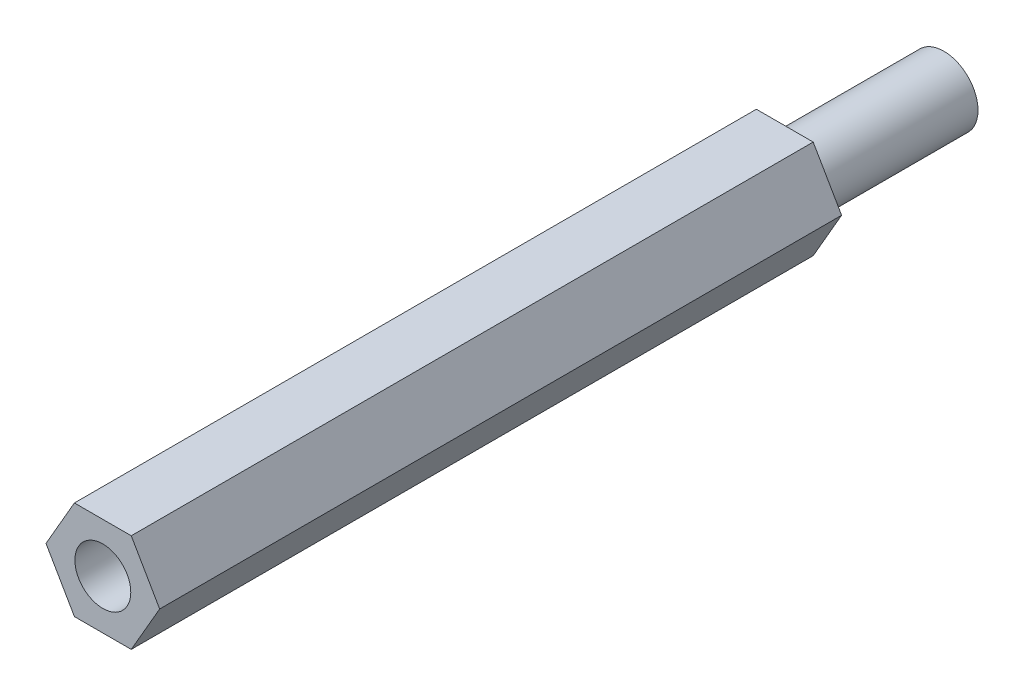
ISO-10303-21;
HEADER;
FILE_DESCRIPTION(('STEP AP214'),'2;1');
FILE_NAME('part.step','',(''),(''),'','','');
FILE_SCHEMA(('AUTOMOTIVE_DESIGN { 1 0 10303 214 1 1 1 1 }'));
ENDSEC;
DATA;
#1=APPLICATION_CONTEXT('core data for automotive mechanical design processes');
#2=APPLICATION_PROTOCOL_DEFINITION('international standard','automotive_design',2000,#1);
#3=PRODUCT_CONTEXT('',#1,'mechanical');
#4=PRODUCT('Part','Part','',(#3));
#5=PRODUCT_RELATED_PRODUCT_CATEGORY('part','',(#4));
#6=PRODUCT_DEFINITION_FORMATION('','',#4);
#7=PRODUCT_DEFINITION_CONTEXT('part definition',#1,'design');
#8=PRODUCT_DEFINITION('design','',#6,#7);
#9=PRODUCT_DEFINITION_SHAPE('','',#8);
#10=(LENGTH_UNIT() NAMED_UNIT(*) SI_UNIT(.MILLI.,.METRE.));
#11=(NAMED_UNIT(*) PLANE_ANGLE_UNIT() SI_UNIT($,.RADIAN.));
#12=(NAMED_UNIT(*) SI_UNIT($,.STERADIAN.) SOLID_ANGLE_UNIT());
#13=UNCERTAINTY_MEASURE_WITH_UNIT(LENGTH_MEASURE(1.E-05),#10,'distance_accuracy_value','');
#14=(GEOMETRIC_REPRESENTATION_CONTEXT(3) GLOBAL_UNCERTAINTY_ASSIGNED_CONTEXT((#13)) GLOBAL_UNIT_ASSIGNED_CONTEXT((#10,
#11,#12)) REPRESENTATION_CONTEXT('',''));
#15=CARTESIAN_POINT('',(0.,0.,0.));
#16=DIRECTION('',(0.,0.,1.));
#17=DIRECTION('',(1.,0.,0.));
#18=AXIS2_PLACEMENT_3D('',#15,#16,#17);
#19=CARTESIAN_POINT('',(0.,0.,-30.));
#20=DIRECTION('',(0.,0.,1.));
#21=DIRECTION('',(1.,0.,0.));
#22=AXIS2_PLACEMENT_3D('',#19,#20,#21);
#23=PLANE('',#22);
#24=DIRECTION('',(1.,0.,0.));
#25=VECTOR('',#24,1.);
#26=CARTESIAN_POINT('',(-1.25,-2.1650635094611,-30.));
#27=LINE('',#26,#25);
#28=CARTESIAN_POINT('',(-1.25,-2.1650635094611,-30.));
#29=VERTEX_POINT('',#28);
#30=CARTESIAN_POINT('',(1.25,-2.1650635094611,-30.));
#31=VERTEX_POINT('',#30);
#32=EDGE_CURVE('E154',#29,#31,#27,.T.);
#33=ORIENTED_EDGE('',*,*,#32,.F.);
#34=DIRECTION('',(0.5,-0.866025403784439,0.));
#35=VECTOR('',#34,1.);
#36=CARTESIAN_POINT('',(-2.5,0.,-30.));
#37=LINE('',#36,#35);
#38=CARTESIAN_POINT('',(-2.5,0.,-30.));
#39=VERTEX_POINT('',#38);
#40=EDGE_CURVE('E124',#39,#29,#37,.T.);
#41=ORIENTED_EDGE('',*,*,#40,.F.);
#42=DIRECTION('',(-0.5,-0.866025403784439,0.));
#43=VECTOR('',#42,1.);
#44=CARTESIAN_POINT('',(-1.25,2.1650635094611,-30.));
#45=LINE('',#44,#43);
#46=CARTESIAN_POINT('',(-1.25,2.1650635094611,-30.));
#47=VERTEX_POINT('',#46);
#48=EDGE_CURVE('E108',#47,#39,#45,.T.);
#49=ORIENTED_EDGE('',*,*,#48,.F.);
#50=DIRECTION('',(-1.,0.,0.));
#51=VECTOR('',#50,1.);
#52=CARTESIAN_POINT('',(1.25,2.1650635094611,-30.));
#53=LINE('',#52,#51);
#54=CARTESIAN_POINT('',(1.25,2.1650635094611,-30.));
#55=VERTEX_POINT('',#54);
#56=EDGE_CURVE('E122',#55,#47,#53,.T.);
#57=ORIENTED_EDGE('',*,*,#56,.F.);
#58=DIRECTION('',(-0.5,0.866025403784439,0.));
#59=VECTOR('',#58,1.);
#60=CARTESIAN_POINT('',(2.5,0.,-30.));
#61=LINE('',#60,#59);
#62=CARTESIAN_POINT('',(2.5,0.,-30.));
#63=VERTEX_POINT('',#62);
#64=EDGE_CURVE('E129',#63,#55,#61,.T.);
#65=ORIENTED_EDGE('',*,*,#64,.F.);
#66=DIRECTION('',(0.5,0.866025403784438,0.));
#67=VECTOR('',#66,1.);
#68=CARTESIAN_POINT('',(1.25,-2.1650635094611,-30.));
#69=LINE('',#68,#67);
#70=EDGE_CURVE('E132',#31,#63,#69,.T.);
#71=ORIENTED_EDGE('',*,*,#70,.F.);
#72=EDGE_LOOP('',(#33,#41,#49,#57,#65,#71));
#73=FACE_BOUND('',#72,.T.);
#74=CARTESIAN_POINT('',(0.,0.,-30.));
#75=DIRECTION('',(0.,0.,1.));
#76=DIRECTION('',(1.,0.,0.));
#77=AXIS2_PLACEMENT_3D('',#74,#75,#76);
#78=CIRCLE('',#77,1.5);
#79=CARTESIAN_POINT('',(1.5,0.,-30.));
#80=VERTEX_POINT('',#79);
#81=EDGE_CURVE('E11',#80,#80,#78,.F.);
#82=ORIENTED_EDGE('',*,*,#81,.F.);
#83=EDGE_LOOP('',(#82));
#84=FACE_BOUND('',#83,.T.);
#85=ADVANCED_FACE('F39',(#73,#84),#23,.F.);
#86=CARTESIAN_POINT('',(-1.25,-2.1650635094611,-30.));
#87=DIRECTION('',(0.,-1.,0.));
#88=DIRECTION('',(1.,0.,0.));
#89=AXIS2_PLACEMENT_3D('',#86,#87,#88);
#90=PLANE('',#89);
#91=DIRECTION('',(1.,0.,0.));
#92=VECTOR('',#91,1.);
#93=CARTESIAN_POINT('',(-1.25,-2.1650635094611,0.));
#94=LINE('',#93,#92);
#95=CARTESIAN_POINT('',(-1.25,-2.1650635094611,0.));
#96=VERTEX_POINT('',#95);
#97=CARTESIAN_POINT('',(1.25,-2.1650635094611,0.));
#98=VERTEX_POINT('',#97);
#99=EDGE_CURVE('E138',#96,#98,#94,.T.);
#100=ORIENTED_EDGE('',*,*,#99,.F.);
#101=DIRECTION('',(0.,0.,1.));
#102=VECTOR('',#101,1.);
#103=CARTESIAN_POINT('',(-1.25,-2.1650635094611,-30.));
#104=LINE('',#103,#102);
#105=EDGE_CURVE('E49',#29,#96,#104,.T.);
#106=ORIENTED_EDGE('',*,*,#105,.F.);
#107=ORIENTED_EDGE('',*,*,#32,.T.);
#108=DIRECTION('',(0.,0.,1.));
#109=VECTOR('',#108,1.);
#110=CARTESIAN_POINT('',(1.25,-2.1650635094611,-30.));
#111=LINE('',#110,#109);
#112=EDGE_CURVE('E96',#31,#98,#111,.T.);
#113=ORIENTED_EDGE('',*,*,#112,.T.);
#114=EDGE_LOOP('',(#100,#106,#107,#113));
#115=FACE_BOUND('',#114,.T.);
#116=ADVANCED_FACE('F41',(#115),#90,.T.);
#117=CARTESIAN_POINT('',(-2.5,0.,-30.));
#118=DIRECTION('',(-0.866025403784439,-0.5,0.));
#119=DIRECTION('',(0.5,-0.866025403784439,0.));
#120=AXIS2_PLACEMENT_3D('',#117,#118,#119);
#121=PLANE('',#120);
#122=DIRECTION('',(0.5,-0.866025403784439,0.));
#123=VECTOR('',#122,1.);
#124=CARTESIAN_POINT('',(-2.5,0.,0.));
#125=LINE('',#124,#123);
#126=CARTESIAN_POINT('',(-2.5,0.,0.));
#127=VERTEX_POINT('',#126);
#128=EDGE_CURVE('E151',#127,#96,#125,.T.);
#129=ORIENTED_EDGE('',*,*,#128,.F.);
#130=DIRECTION('',(0.,0.,1.));
#131=VECTOR('',#130,1.);
#132=CARTESIAN_POINT('',(-2.5,0.,-30.));
#133=LINE('',#132,#131);
#134=EDGE_CURVE('E83',#39,#127,#133,.T.);
#135=ORIENTED_EDGE('',*,*,#134,.F.);
#136=ORIENTED_EDGE('',*,*,#40,.T.);
#137=ORIENTED_EDGE('',*,*,#105,.T.);
#138=EDGE_LOOP('',(#129,#135,#136,#137));
#139=FACE_BOUND('',#138,.T.);
#140=ADVANCED_FACE('F169',(#139),#121,.T.);
#141=CARTESIAN_POINT('',(-1.25,2.1650635094611,-30.));
#142=DIRECTION('',(-0.866025403784439,0.5,0.));
#143=DIRECTION('',(-0.5,-0.866025403784439,0.));
#144=AXIS2_PLACEMENT_3D('',#141,#142,#143);
#145=PLANE('',#144);
#146=DIRECTION('',(-0.5,-0.866025403784439,0.));
#147=VECTOR('',#146,1.);
#148=CARTESIAN_POINT('',(-1.25,2.1650635094611,0.));
#149=LINE('',#148,#147);
#150=CARTESIAN_POINT('',(-1.25,2.1650635094611,0.));
#151=VERTEX_POINT('',#150);
#152=EDGE_CURVE('E110',#151,#127,#149,.T.);
#153=ORIENTED_EDGE('',*,*,#152,.F.);
#154=DIRECTION('',(0.,0.,1.));
#155=VECTOR('',#154,1.);
#156=CARTESIAN_POINT('',(-1.25,2.1650635094611,-30.));
#157=LINE('',#156,#155);
#158=EDGE_CURVE('E105',#47,#151,#157,.T.);
#159=ORIENTED_EDGE('',*,*,#158,.F.);
#160=ORIENTED_EDGE('',*,*,#48,.T.);
#161=ORIENTED_EDGE('',*,*,#134,.T.);
#162=EDGE_LOOP('',(#153,#159,#160,#161));
#163=FACE_BOUND('',#162,.T.);
#164=ADVANCED_FACE('F107',(#163),#145,.T.);
#165=CARTESIAN_POINT('',(1.25,2.1650635094611,-30.));
#166=DIRECTION('',(0.,1.,0.));
#167=DIRECTION('',(-1.,0.,0.));
#168=AXIS2_PLACEMENT_3D('',#165,#166,#167);
#169=PLANE('',#168);
#170=DIRECTION('',(-1.,0.,0.));
#171=VECTOR('',#170,1.);
#172=CARTESIAN_POINT('',(1.25,2.1650635094611,0.));
#173=LINE('',#172,#171);
#174=CARTESIAN_POINT('',(1.25,2.1650635094611,0.));
#175=VERTEX_POINT('',#174);
#176=EDGE_CURVE('E148',#175,#151,#173,.T.);
#177=ORIENTED_EDGE('',*,*,#176,.F.);
#178=DIRECTION('',(0.,0.,1.));
#179=VECTOR('',#178,1.);
#180=CARTESIAN_POINT('',(1.25,2.1650635094611,-30.));
#181=LINE('',#180,#179);
#182=EDGE_CURVE('E116',#55,#175,#181,.T.);
#183=ORIENTED_EDGE('',*,*,#182,.F.);
#184=ORIENTED_EDGE('',*,*,#56,.T.);
#185=ORIENTED_EDGE('',*,*,#158,.T.);
#186=EDGE_LOOP('',(#177,#183,#184,#185));
#187=FACE_BOUND('',#186,.T.);
#188=ADVANCED_FACE('F127',(#187),#169,.T.);
#189=CARTESIAN_POINT('',(2.5,0.,-30.));
#190=DIRECTION('',(0.866025403784439,0.5,0.));
#191=DIRECTION('',(-0.5,0.866025403784439,0.));
#192=AXIS2_PLACEMENT_3D('',#189,#190,#191);
#193=PLANE('',#192);
#194=DIRECTION('',(-0.5,0.866025403784439,0.));
#195=VECTOR('',#194,1.);
#196=CARTESIAN_POINT('',(2.5,0.,0.));
#197=LINE('',#196,#195);
#198=CARTESIAN_POINT('',(2.5,0.,0.));
#199=VERTEX_POINT('',#198);
#200=EDGE_CURVE('E145',#199,#175,#197,.T.);
#201=ORIENTED_EDGE('',*,*,#200,.F.);
#202=DIRECTION('',(0.,0.,1.));
#203=VECTOR('',#202,1.);
#204=CARTESIAN_POINT('',(2.5,0.,-30.));
#205=LINE('',#204,#203);
#206=EDGE_CURVE('E161',#63,#199,#205,.T.);
#207=ORIENTED_EDGE('',*,*,#206,.F.);
#208=ORIENTED_EDGE('',*,*,#64,.T.);
#209=ORIENTED_EDGE('',*,*,#182,.T.);
#210=EDGE_LOOP('',(#201,#207,#208,#209));
#211=FACE_BOUND('',#210,.T.);
#212=ADVANCED_FACE('F193',(#211),#193,.T.);
#213=CARTESIAN_POINT('',(1.25,-2.1650635094611,-30.));
#214=DIRECTION('',(0.866025403784438,-0.5,0.));
#215=DIRECTION('',(0.5,0.866025403784438,0.));
#216=AXIS2_PLACEMENT_3D('',#213,#214,#215);
#217=PLANE('',#216);
#218=DIRECTION('',(0.5,0.866025403784438,0.));
#219=VECTOR('',#218,1.);
#220=CARTESIAN_POINT('',(1.25,-2.1650635094611,0.));
#221=LINE('',#220,#219);
#222=EDGE_CURVE('E141',#98,#199,#221,.T.);
#223=ORIENTED_EDGE('',*,*,#222,.F.);
#224=ORIENTED_EDGE('',*,*,#112,.F.);
#225=ORIENTED_EDGE('',*,*,#70,.T.);
#226=ORIENTED_EDGE('',*,*,#206,.T.);
#227=EDGE_LOOP('',(#223,#224,#225,#226));
#228=FACE_BOUND('',#227,.T.);
#229=ADVANCED_FACE('F165',(#228),#217,.T.);
#230=CARTESIAN_POINT('',(0.,0.,0.));
#231=DIRECTION('',(0.,0.,1.));
#232=DIRECTION('',(1.,0.,0.));
#233=AXIS2_PLACEMENT_3D('',#230,#231,#232);
#234=PLANE('',#233);
#235=CARTESIAN_POINT('',(0.,0.,0.));
#236=DIRECTION('',(0.,0.,1.));
#237=DIRECTION('',(1.,0.,0.));
#238=AXIS2_PLACEMENT_3D('',#235,#236,#237);
#239=CIRCLE('',#238,1.22950000000001);
#240=CARTESIAN_POINT('',(1.22950000000001,0.,0.));
#241=VERTEX_POINT('',#240);
#242=EDGE_CURVE('E196',#241,#241,#239,.T.);
#243=ORIENTED_EDGE('',*,*,#242,.F.);
#244=EDGE_LOOP('',(#243));
#245=FACE_BOUND('',#244,.T.);
#246=ORIENTED_EDGE('',*,*,#99,.T.);
#247=ORIENTED_EDGE('',*,*,#222,.T.);
#248=ORIENTED_EDGE('',*,*,#200,.T.);
#249=ORIENTED_EDGE('',*,*,#176,.T.);
#250=ORIENTED_EDGE('',*,*,#152,.T.);
#251=ORIENTED_EDGE('',*,*,#128,.T.);
#252=EDGE_LOOP('',(#246,#247,#248,#249,#250,#251));
#253=FACE_BOUND('',#252,.T.);
#254=ADVANCED_FACE('F168',(#245,#253),#234,.T.);
#255=CARTESIAN_POINT('',(0.,0.,-37.));
#256=DIRECTION('',(0.,0.,1.));
#257=DIRECTION('',(1.,0.,0.));
#258=AXIS2_PLACEMENT_3D('',#255,#256,#257);
#259=CYLINDRICAL_SURFACE('',#258,1.5);
#260=CARTESIAN_POINT('',(0.,0.,-37.));
#261=DIRECTION('',(0.,0.,-1.));
#262=DIRECTION('',(-1.,0.,0.));
#263=AXIS2_PLACEMENT_3D('',#260,#261,#262);
#264=CIRCLE('',#263,1.5);
#265=CARTESIAN_POINT('',(-1.5,0.,-37.));
#266=VERTEX_POINT('',#265);
#267=EDGE_CURVE('E142',#266,#266,#264,.T.);
#268=ORIENTED_EDGE('',*,*,#267,.F.);
#269=EDGE_LOOP('',(#268));
#270=FACE_BOUND('',#269,.T.);
#271=ORIENTED_EDGE('',*,*,#81,.T.);
#272=EDGE_LOOP('',(#271));
#273=FACE_BOUND('',#272,.T.);
#274=ADVANCED_FACE('F183',(#270,#273),#259,.T.);
#275=CARTESIAN_POINT('',(0.,0.,-37.));
#276=DIRECTION('',(0.,0.,-1.));
#277=DIRECTION('',(-1.,0.,0.));
#278=AXIS2_PLACEMENT_3D('',#275,#276,#277);
#279=PLANE('',#278);
#280=ORIENTED_EDGE('',*,*,#267,.T.);
#281=EDGE_LOOP('',(#280));
#282=FACE_BOUND('',#281,.T.);
#283=ADVANCED_FACE('F191',(#282),#279,.T.);
#284=CARTESIAN_POINT('',(0.,0.,-7.00000000000001));
#285=DIRECTION('',(0.,0.,-1.));
#286=DIRECTION('',(-1.,0.,0.));
#287=AXIS2_PLACEMENT_3D('',#284,#285,#286);
#288=PLANE('',#287);
#289=CARTESIAN_POINT('',(0.,0.,-7.00000000000001));
#290=DIRECTION('',(0.,0.,1.));
#291=DIRECTION('',(1.,0.,0.));
#292=AXIS2_PLACEMENT_3D('',#289,#290,#291);
#293=CIRCLE('',#292,1.22950000000001);
#294=CARTESIAN_POINT('',(1.22950000000001,0.,-7.00000000000001));
#295=VERTEX_POINT('',#294);
#296=EDGE_CURVE('E198',#295,#295,#293,.T.);
#297=ORIENTED_EDGE('',*,*,#296,.T.);
#298=EDGE_LOOP('',(#297));
#299=FACE_BOUND('',#298,.T.);
#300=ADVANCED_FACE('F248',(#299),#288,.F.);
#301=CARTESIAN_POINT('',(0.,0.,0.));
#302=DIRECTION('',(0.,0.,1.));
#303=DIRECTION('',(1.,0.,0.));
#304=AXIS2_PLACEMENT_3D('',#301,#302,#303);
#305=CYLINDRICAL_SURFACE('',#304,1.22950000000001);
#306=ORIENTED_EDGE('',*,*,#296,.F.);
#307=EDGE_LOOP('',(#306));
#308=FACE_BOUND('',#307,.T.);
#309=ORIENTED_EDGE('',*,*,#242,.T.);
#310=EDGE_LOOP('',(#309));
#311=FACE_BOUND('',#310,.T.);
#312=ADVANCED_FACE('F261',(#308,#311),#305,.F.);
#313=CLOSED_SHELL('',(#85,#116,#140,#164,#188,#212,#229,#254,#274,#283,#300,#312));
#314=MANIFOLD_SOLID_BREP('B2',#313);
#315=ADVANCED_BREP_SHAPE_REPRESENTATION('',(#18,#314),#14);
#316=SHAPE_DEFINITION_REPRESENTATION(#9,#315);
ENDSEC;
END-ISO-10303-21;
